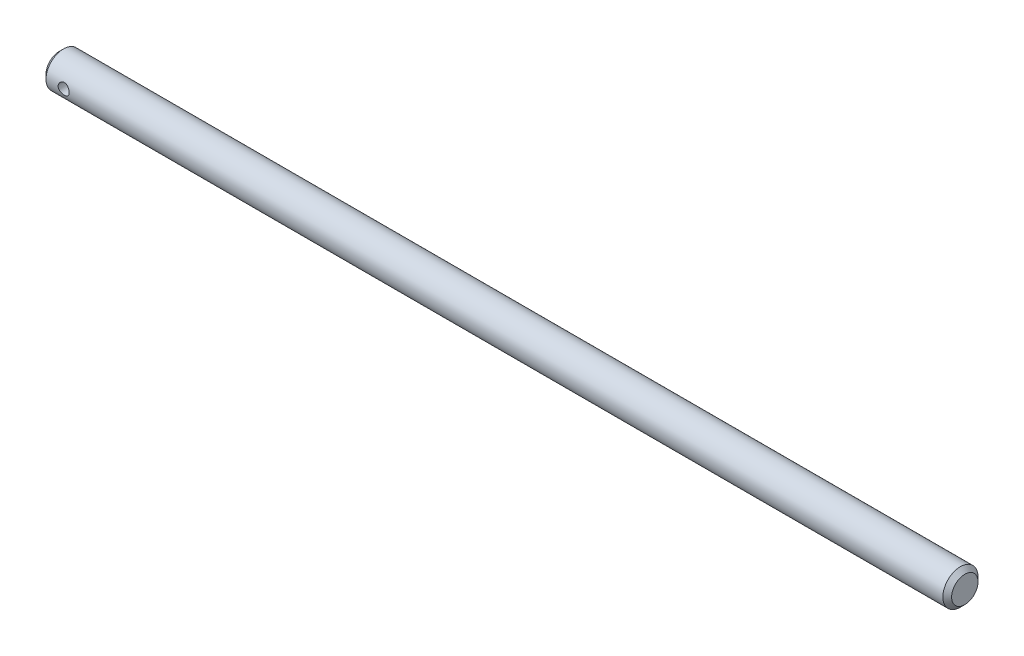
ISO-10303-21;
HEADER;
FILE_DESCRIPTION(('STEP AP214'),'2;1');
FILE_NAME('part.step','',(''),(''),'','','');
FILE_SCHEMA(('AUTOMOTIVE_DESIGN { 1 0 10303 214 1 1 1 1 }'));
ENDSEC;
DATA;
#1=APPLICATION_CONTEXT('core data for automotive mechanical design processes');
#2=APPLICATION_PROTOCOL_DEFINITION('international standard','automotive_design',2000,#1);
#3=PRODUCT_CONTEXT('',#1,'mechanical');
#4=PRODUCT('Part','Part','',(#3));
#5=PRODUCT_RELATED_PRODUCT_CATEGORY('part','',(#4));
#6=PRODUCT_DEFINITION_FORMATION('','',#4);
#7=PRODUCT_DEFINITION_CONTEXT('part definition',#1,'design');
#8=PRODUCT_DEFINITION('design','',#6,#7);
#9=PRODUCT_DEFINITION_SHAPE('','',#8);
#10=(LENGTH_UNIT() NAMED_UNIT(*) SI_UNIT(.MILLI.,.METRE.));
#11=(NAMED_UNIT(*) PLANE_ANGLE_UNIT() SI_UNIT($,.RADIAN.));
#12=(NAMED_UNIT(*) SI_UNIT($,.STERADIAN.) SOLID_ANGLE_UNIT());
#13=UNCERTAINTY_MEASURE_WITH_UNIT(LENGTH_MEASURE(1.E-05),#10,'distance_accuracy_value','');
#14=(GEOMETRIC_REPRESENTATION_CONTEXT(3) GLOBAL_UNCERTAINTY_ASSIGNED_CONTEXT((#13)) GLOBAL_UNIT_ASSIGNED_CONTEXT((#10,
#11,#12)) REPRESENTATION_CONTEXT('',''));
#15=CARTESIAN_POINT('',(0.,0.,0.));
#16=DIRECTION('',(0.,0.,1.));
#17=DIRECTION('',(1.,0.,0.));
#18=AXIS2_PLACEMENT_3D('',#15,#16,#17);
#19=CARTESIAN_POINT('',(163.5125,0.,0.));
#20=DIRECTION('',(-1.,0.,0.));
#21=DIRECTION('',(0.,0.,1.));
#22=AXIS2_PLACEMENT_3D('',#19,#20,#21);
#23=CYLINDRICAL_SURFACE('',#22,6.35);
#24=CARTESIAN_POINT('',(-153.590625,0.,-6.35));
#25=CARTESIAN_POINT('',(-153.590625708958,0.108647206464594,-6.34999945831309));
#26=CARTESIAN_POINT('',(-153.599577272774,0.217301845848293,-6.34718528288435));
#27=CARTESIAN_POINT('',(-153.635053158443,0.431433620221668,-6.3362346936598));
#28=CARTESIAN_POINT('',(-153.661581457916,0.536910030327383,-6.32809707517277));
#29=CARTESIAN_POINT('',(-153.731228876773,0.741566563045664,-6.30738857420431));
#30=CARTESIAN_POINT('',(-153.774322315886,0.840756155964977,-6.29482455629702));
#31=CARTESIAN_POINT('',(-153.875767491814,1.03050149872502,-6.26656051043234));
#32=CARTESIAN_POINT('',(-153.934121632951,1.12105588501877,-6.25085998841099));
#33=CARTESIAN_POINT('',(-154.066328887327,1.29375746923677,-6.21744714312698));
#34=CARTESIAN_POINT('',(-154.140568155034,1.37560054469872,-6.19969099034094));
#35=CARTESIAN_POINT('',(-154.301616072956,1.52590084398375,-6.16442198619055));
#36=CARTESIAN_POINT('',(-154.388427058022,1.5943555757267,-6.14690918068488));
#37=CARTESIAN_POINT('',(-154.574786995045,1.71758509166945,-6.11363942208348));
#38=CARTESIAN_POINT('',(-154.674597745574,1.77197994838332,-6.097936564291));
#39=CARTESIAN_POINT('',(-154.882520300034,1.86308588959219,-6.07072385356284));
#40=CARTESIAN_POINT('',(-154.990629908573,1.89980163237964,-6.05921289629292));
#41=CARTESIAN_POINT('',(-155.208649572955,1.9533943013893,-6.04214576087894));
#42=CARTESIAN_POINT('',(-155.318407364276,1.97083537137487,-6.03642069525594));
#43=CARTESIAN_POINT('',(-155.539429076272,1.98714606121221,-6.03107212536258));
#44=CARTESIAN_POINT('',(-155.650692588679,1.9860206183079,-6.03144699898392));
#45=CARTESIAN_POINT('',(-155.866900705677,1.96567146763226,-6.03810687657257));
#46=CARTESIAN_POINT('',(-155.971921237305,1.94716491867648,-6.04415767521693));
#47=CARTESIAN_POINT('',(-156.177285048503,1.89374166202058,-6.06110715723326));
#48=CARTESIAN_POINT('',(-156.277627829738,1.85882321028226,-6.07200635582194));
#49=CARTESIAN_POINT('',(-156.472496211787,1.7730608855653,-6.09760407372695));
#50=CARTESIAN_POINT('',(-156.566915419473,1.72199181988557,-6.11235576899058));
#51=CARTESIAN_POINT('',(-156.746079331508,1.60553432921335,-6.1439719732086));
#52=CARTESIAN_POINT('',(-156.830821514028,1.54014218453005,-6.16083703051349));
#53=CARTESIAN_POINT('',(-156.992280222674,1.39337566476413,-6.19571925383283));
#54=CARTESIAN_POINT('',(-157.068455797975,1.31140925581611,-6.21375391749042));
#55=CARTESIAN_POINT('',(-157.206111631058,1.13564099785166,-6.24826618580833));
#56=CARTESIAN_POINT('',(-157.267590800135,1.04183827279157,-6.26474367505916));
#57=CARTESIAN_POINT('',(-157.374475205654,0.844017569113914,-6.29445805638178));
#58=CARTESIAN_POINT('',(-157.419751415049,0.739925664734365,-6.3076686877903));
#59=CARTESIAN_POINT('',(-157.491990388852,0.525094164729957,-6.32917129877829));
#60=CARTESIAN_POINT('',(-157.518958714053,0.414356598775321,-6.33746477178679));
#61=CARTESIAN_POINT('',(-157.552894892594,0.193968937198424,-6.34795830664584));
#62=CARTESIAN_POINT('',(-157.560595062955,0.084442059952291,-6.35038136346505));
#63=CARTESIAN_POINT('',(-157.557841115213,-0.134350610350476,-6.34952057072936));
#64=CARTESIAN_POINT('',(-157.547389649125,-0.243616439211578,-6.34623755485052));
#65=CARTESIAN_POINT('',(-157.509216996737,-0.455960691099158,-6.33448002484496));
#66=CARTESIAN_POINT('',(-157.481931562665,-0.559125403243237,-6.32613659063216));
#67=CARTESIAN_POINT('',(-157.411397215618,-0.759383687067439,-6.30523442689622));
#68=CARTESIAN_POINT('',(-157.36814633111,-0.856476507212883,-6.29267517679021));
#69=CARTESIAN_POINT('',(-157.265730018729,-1.04446769559211,-6.26425186630585));
#70=CARTESIAN_POINT('',(-157.206202307349,-1.13515733691314,-6.24831470073047));
#71=CARTESIAN_POINT('',(-157.073356778938,-1.30550578839944,-6.21495788380444));
#72=CARTESIAN_POINT('',(-157.00003522183,-1.38516159664479,-6.1975378310852));
#73=CARTESIAN_POINT('',(-156.838239012042,-1.53445759738396,-6.16230979376987));
#74=CARTESIAN_POINT('',(-156.749279046314,-1.60357585589008,-6.14451378896475));
#75=CARTESIAN_POINT('',(-156.560636496502,-1.7259498476418,-6.11127091014274));
#76=CARTESIAN_POINT('',(-156.460954082757,-1.77920583282822,-6.09582399881705));
#77=CARTESIAN_POINT('',(-156.253902038068,-1.86801257525363,-6.06919954450254));
#78=CARTESIAN_POINT('',(-156.146564056521,-1.90363188545171,-6.05800551091538));
#79=CARTESIAN_POINT('',(-155.926992416968,-1.9561634472997,-6.04124983715342));
#80=CARTESIAN_POINT('',(-155.814760638805,-1.97308281744718,-6.03568605378198));
#81=CARTESIAN_POINT('',(-155.594043510966,-1.98722307276027,-6.03104414683278));
#82=CARTESIAN_POINT('',(-155.485618267017,-1.98530018899349,-6.03168409802724));
#83=CARTESIAN_POINT('',(-155.270716596404,-1.96387748779526,-6.03869268471746));
#84=CARTESIAN_POINT('',(-155.164240079067,-1.9443784903074,-6.0450610529767));
#85=CARTESIAN_POINT('',(-154.957789462148,-1.8889302123787,-6.06261192516131));
#86=CARTESIAN_POINT('',(-154.857742987264,-1.8532259481954,-6.07372258377032));
#87=CARTESIAN_POINT('',(-154.664980843515,-1.76657360894313,-6.0994878050412));
#88=CARTESIAN_POINT('',(-154.5722666707,-1.71562243305227,-6.11414308847041));
#89=CARTESIAN_POINT('',(-154.392874521927,-1.59759134083921,-6.14606160665685));
#90=CARTESIAN_POINT('',(-154.306574594418,-1.52995841969561,-6.16340443915194));
#91=CARTESIAN_POINT('',(-154.146271704122,-1.38145678179263,-6.1983778562867));
#92=CARTESIAN_POINT('',(-154.072272041227,-1.30058452472173,-6.21600851675563));
#93=CARTESIAN_POINT('',(-153.936251470349,-1.12472257723208,-6.25026169224552));
#94=CARTESIAN_POINT('',(-153.874700605886,-1.02935813699873,-6.26683248997443));
#95=CARTESIAN_POINT('',(-153.768585472216,-0.829118131596679,-6.29644996258793));
#96=CARTESIAN_POINT('',(-153.72401452535,-0.724246325500285,-6.30949802226367));
#97=CARTESIAN_POINT('',(-153.656361203921,-0.5171243711562,-6.32969033039384));
#98=CARTESIAN_POINT('',(-153.631781148153,-0.415401660166173,-6.3372403227975));
#99=CARTESIAN_POINT('',(-153.598914353551,-0.209121209011396,-6.34739491790518));
#100=CARTESIAN_POINT('',(-153.590624317686,-0.104564046871735,-6.35000052132933));
#101=CARTESIAN_POINT('',(-153.590625,0.,-6.35));
#102=B_SPLINE_CURVE_WITH_KNOTS('',3,(#24,#25,#26,#27,#28,#29,#30,#31,#32,#33,#34,#35,#36,#37,
#38,#39,#40,#41,#42,#43,#44,#45,#46,#47,#48,#49,#50,#51,#52,#53,#54,#55,#56,#57,#58,#59,#60,#61,
#62,#63,#64,#65,#66,#67,#68,#69,#70,#71,#72,#73,#74,#75,#76,#77,#78,#79,#80,#81,#82,#83,#84,#85,
#86,#87,#88,#89,#90,#91,#92,#93,#94,#95,#96,#97,#98,#99,#100,#101),.UNSPECIFIED.,.T.,.F.,(4,2,2,
2,2,2,2,2,2,2,2,2,2,2,2,2,2,2,2,2,2,2,2,2,2,2,2,2,2,2,2,2,2,2,2,2,2,2,4),(0.,0.325557275974112,
0.651188250816651,0.976316435733881,1.30149587547397,1.63572542734819,1.97001713297153,
2.31257111855402,2.65503479468754,2.98718525890445,3.31924739843533,3.63818356407697,
3.95715362966767,4.2807833281887,4.6044971729145,4.94294711306373,5.28142211768626,
5.62253543845017,5.96354510385112,6.29138265070334,6.61917230343371,6.93881369922568,
7.25849457992277,7.58596915522129,7.9135326506346,8.2540757370712,8.59461341436652,
8.9338168375846,9.27289109187037,9.59663123029796,9.92035626670015,10.2393418753238,
10.5583924013932,10.8899247850027,11.2215459684535,11.5639956066585,11.9063104309798,
12.2196961069949,12.5330183485151),.UNSPECIFIED.);
#103=CARTESIAN_POINT('',(-153.590625,0.,-6.35));
#104=VERTEX_POINT('',#103);
#105=EDGE_CURVE('E10',#104,#104,#102,.T.);
#106=ORIENTED_EDGE('',*,*,#105,.T.);
#107=EDGE_LOOP('',(#106));
#108=FACE_BOUND('',#107,.T.);
#109=CARTESIAN_POINT('',(-153.590625,0.,6.35));
#110=CARTESIAN_POINT('',(-153.590625708958,-0.108647206464594,6.34999945831309));
#111=CARTESIAN_POINT('',(-153.599577272774,-0.217301845848293,6.34718528288435));
#112=CARTESIAN_POINT('',(-153.635053158443,-0.431433620221668,6.3362346936598));
#113=CARTESIAN_POINT('',(-153.661581457916,-0.536910030327383,6.32809707517277));
#114=CARTESIAN_POINT('',(-153.731228876773,-0.741566563045664,6.30738857420431));
#115=CARTESIAN_POINT('',(-153.774322315886,-0.840756155964977,6.29482455629702));
#116=CARTESIAN_POINT('',(-153.875767491814,-1.03050149872502,6.26656051043234));
#117=CARTESIAN_POINT('',(-153.934121632951,-1.12105588501877,6.25085998841099));
#118=CARTESIAN_POINT('',(-154.066328887327,-1.29375746923676,6.21744714312698));
#119=CARTESIAN_POINT('',(-154.140568155034,-1.37560054469872,6.19969099034094));
#120=CARTESIAN_POINT('',(-154.301616072956,-1.52590084398375,6.16442198619055));
#121=CARTESIAN_POINT('',(-154.388427058022,-1.5943555757267,6.14690918068488));
#122=CARTESIAN_POINT('',(-154.574786995045,-1.71758509166945,6.11363942208348));
#123=CARTESIAN_POINT('',(-154.674597745574,-1.77197994838332,6.097936564291));
#124=CARTESIAN_POINT('',(-154.882520300034,-1.86308588959219,6.07072385356284));
#125=CARTESIAN_POINT('',(-154.990629908573,-1.89980163237964,6.05921289629292));
#126=CARTESIAN_POINT('',(-155.208649572955,-1.9533943013893,6.04214576087894));
#127=CARTESIAN_POINT('',(-155.318407364276,-1.97083537137487,6.03642069525594));
#128=CARTESIAN_POINT('',(-155.539429076272,-1.98714606121221,6.03107212536258));
#129=CARTESIAN_POINT('',(-155.650692588679,-1.9860206183079,6.03144699898392));
#130=CARTESIAN_POINT('',(-155.866900705677,-1.96567146763226,6.03810687657257));
#131=CARTESIAN_POINT('',(-155.971921237305,-1.94716491867648,6.04415767521693));
#132=CARTESIAN_POINT('',(-156.177285048503,-1.89374166202058,6.06110715723326));
#133=CARTESIAN_POINT('',(-156.277627829738,-1.85882321028226,6.07200635582194));
#134=CARTESIAN_POINT('',(-156.472496211787,-1.7730608855653,6.09760407372695));
#135=CARTESIAN_POINT('',(-156.566915419473,-1.72199181988557,6.11235576899058));
#136=CARTESIAN_POINT('',(-156.746079331508,-1.60553432921335,6.1439719732086));
#137=CARTESIAN_POINT('',(-156.830821514028,-1.54014218453005,6.16083703051349));
#138=CARTESIAN_POINT('',(-156.992280222674,-1.39337566476413,6.19571925383283));
#139=CARTESIAN_POINT('',(-157.068455797975,-1.31140925581611,6.21375391749042));
#140=CARTESIAN_POINT('',(-157.206111631058,-1.13564099785166,6.24826618580833));
#141=CARTESIAN_POINT('',(-157.267590800135,-1.04183827279157,6.26474367505916));
#142=CARTESIAN_POINT('',(-157.374475205654,-0.844017569113914,6.29445805638178));
#143=CARTESIAN_POINT('',(-157.419751415049,-0.739925664734365,6.3076686877903));
#144=CARTESIAN_POINT('',(-157.491990388852,-0.525094164729956,6.32917129877829));
#145=CARTESIAN_POINT('',(-157.518958714053,-0.41435659877532,6.33746477178679));
#146=CARTESIAN_POINT('',(-157.552894892594,-0.193968937198424,6.34795830664584));
#147=CARTESIAN_POINT('',(-157.560595062955,-0.0844420599522901,6.35038136346505));
#148=CARTESIAN_POINT('',(-157.557841115213,0.134350610350477,6.34952057072936));
#149=CARTESIAN_POINT('',(-157.547389649125,0.243616439211579,6.34623755485052));
#150=CARTESIAN_POINT('',(-157.509216996737,0.455960691099159,6.33448002484496));
#151=CARTESIAN_POINT('',(-157.481931562665,0.559125403243238,6.32613659063216));
#152=CARTESIAN_POINT('',(-157.411397215618,0.759383687067439,6.30523442689622));
#153=CARTESIAN_POINT('',(-157.36814633111,0.856476507212884,6.29267517679021));
#154=CARTESIAN_POINT('',(-157.265730018729,1.04446769559211,6.26425186630585));
#155=CARTESIAN_POINT('',(-157.206202307349,1.13515733691314,6.24831470073047));
#156=CARTESIAN_POINT('',(-157.073356778938,1.30550578839944,6.21495788380444));
#157=CARTESIAN_POINT('',(-157.00003522183,1.38516159664479,6.1975378310852));
#158=CARTESIAN_POINT('',(-156.838239012042,1.53445759738396,6.16230979376987));
#159=CARTESIAN_POINT('',(-156.749279046314,1.60357585589008,6.14451378896475));
#160=CARTESIAN_POINT('',(-156.560636496502,1.7259498476418,6.11127091014274));
#161=CARTESIAN_POINT('',(-156.460954082757,1.77920583282822,6.09582399881705));
#162=CARTESIAN_POINT('',(-156.253902038068,1.86801257525363,6.06919954450254));
#163=CARTESIAN_POINT('',(-156.146564056521,1.90363188545171,6.05800551091538));
#164=CARTESIAN_POINT('',(-155.926992416968,1.9561634472997,6.04124983715342));
#165=CARTESIAN_POINT('',(-155.814760638805,1.97308281744718,6.03568605378198));
#166=CARTESIAN_POINT('',(-155.594043510966,1.98722307276027,6.03104414683278));
#167=CARTESIAN_POINT('',(-155.485618267017,1.98530018899349,6.03168409802724));
#168=CARTESIAN_POINT('',(-155.270716596404,1.96387748779526,6.03869268471746));
#169=CARTESIAN_POINT('',(-155.164240079067,1.9443784903074,6.0450610529767));
#170=CARTESIAN_POINT('',(-154.957789462148,1.8889302123787,6.06261192516131));
#171=CARTESIAN_POINT('',(-154.857742987264,1.8532259481954,6.07372258377032));
#172=CARTESIAN_POINT('',(-154.664980843515,1.76657360894313,6.0994878050412));
#173=CARTESIAN_POINT('',(-154.5722666707,1.71562243305227,6.11414308847041));
#174=CARTESIAN_POINT('',(-154.392874521927,1.59759134083921,6.14606160665685));
#175=CARTESIAN_POINT('',(-154.306574594418,1.52995841969561,6.16340443915193));
#176=CARTESIAN_POINT('',(-154.146271704122,1.38145678179263,6.1983778562867));
#177=CARTESIAN_POINT('',(-154.072272041227,1.30058452472173,6.21600851675563));
#178=CARTESIAN_POINT('',(-153.936251470349,1.12472257723208,6.25026169224552));
#179=CARTESIAN_POINT('',(-153.874700605886,1.02935813699873,6.26683248997443));
#180=CARTESIAN_POINT('',(-153.768585472216,0.829118131596678,6.29644996258793));
#181=CARTESIAN_POINT('',(-153.72401452535,0.724246325500284,6.30949802226367));
#182=CARTESIAN_POINT('',(-153.656361203921,0.5171243711562,6.32969033039384));
#183=CARTESIAN_POINT('',(-153.631781148153,0.415401660166174,6.33724032279749));
#184=CARTESIAN_POINT('',(-153.598914353551,0.209121209011397,6.34739491790517));
#185=CARTESIAN_POINT('',(-153.590624317686,0.104564046871736,6.35000052132933));
#186=CARTESIAN_POINT('',(-153.590625,0.,6.35));
#187=B_SPLINE_CURVE_WITH_KNOTS('',3,(#109,#110,#111,#112,#113,#114,#115,#116,#117,#118,#119,
#120,#121,#122,#123,#124,#125,#126,#127,#128,#129,#130,#131,#132,#133,#134,#135,#136,#137,#138,
#139,#140,#141,#142,#143,#144,#145,#146,#147,#148,#149,#150,#151,#152,#153,#154,#155,#156,#157,
#158,#159,#160,#161,#162,#163,#164,#165,#166,#167,#168,#169,#170,#171,#172,#173,#174,#175,#176,
#177,#178,#179,#180,#181,#182,#183,#184,#185,#186),.UNSPECIFIED.,.T.,.F.,(4,2,2,2,2,2,2,2,2,2,2,
2,2,2,2,2,2,2,2,2,2,2,2,2,2,2,2,2,2,2,2,2,2,2,2,2,2,2,4),(0.,0.325557275974112,
0.651188250816651,0.976316435733881,1.30149587547397,1.63572542734816,1.97001713297153,
2.31257111855402,2.65503479468754,2.98718525890445,3.31924739843533,3.63818356407697,
3.95715362966768,4.2807833281887,4.60449717291451,4.94294711306373,5.28142211768626,
5.62253543845017,5.96354510385112,6.29138265070335,6.61917230343371,6.93881369922568,
7.25849457992278,7.5859691552213,7.9135326506346,8.2540757370712,8.59461341436652,
8.9338168375846,9.27289109187037,9.59663123029796,9.92035626670015,10.2393418753239,
10.5583924013932,10.8899247850027,11.2215459684535,11.5639956066585,11.9063104309798,
12.2196961069949,12.5330183485151),.UNSPECIFIED.);
#188=CARTESIAN_POINT('',(-153.590625,0.,6.35));
#189=VERTEX_POINT('',#188);
#190=EDGE_CURVE('E57',#189,#189,#187,.T.);
#191=ORIENTED_EDGE('',*,*,#190,.T.);
#192=EDGE_LOOP('',(#191));
#193=FACE_BOUND('',#192,.T.);
#194=CARTESIAN_POINT('',(-161.925,0.,0.));
#195=DIRECTION('',(1.,0.,0.));
#196=DIRECTION('',(0.,0.,-1.));
#197=AXIS2_PLACEMENT_3D('',#194,#195,#196);
#198=CIRCLE('',#197,6.35);
#199=CARTESIAN_POINT('',(-161.925,0.,-6.35));
#200=VERTEX_POINT('',#199);
#201=EDGE_CURVE('E101',#200,#200,#198,.T.);
#202=ORIENTED_EDGE('',*,*,#201,.T.);
#203=EDGE_LOOP('',(#202));
#204=FACE_BOUND('',#203,.T.);
#205=CARTESIAN_POINT('',(161.925,0.,0.));
#206=DIRECTION('',(1.,0.,0.));
#207=DIRECTION('',(0.,0.,-1.));
#208=AXIS2_PLACEMENT_3D('',#205,#206,#207);
#209=CIRCLE('',#208,6.35);
#210=CARTESIAN_POINT('',(161.925,0.,-6.35));
#211=VERTEX_POINT('',#210);
#212=EDGE_CURVE('E104',#211,#211,#209,.F.);
#213=ORIENTED_EDGE('',*,*,#212,.T.);
#214=EDGE_LOOP('',(#213));
#215=FACE_BOUND('',#214,.T.);
#216=ADVANCED_FACE('F43',(#108,#193,#204,#215),#23,.T.);
#217=CARTESIAN_POINT('',(163.5125,0.,0.));
#218=DIRECTION('',(1.,0.,0.));
#219=DIRECTION('',(0.,0.,-1.));
#220=AXIS2_PLACEMENT_3D('',#217,#218,#219);
#221=PLANE('',#220);
#222=CARTESIAN_POINT('',(163.5125,0.,0.));
#223=DIRECTION('',(1.,0.,0.));
#224=DIRECTION('',(0.,0.,-1.));
#225=AXIS2_PLACEMENT_3D('',#222,#223,#224);
#226=CIRCLE('',#225,4.76250000000014);
#227=CARTESIAN_POINT('',(163.5125,0.,-4.76250000000014));
#228=VERTEX_POINT('',#227);
#229=EDGE_CURVE('E62',#228,#228,#226,.T.);
#230=ORIENTED_EDGE('',*,*,#229,.T.);
#231=EDGE_LOOP('',(#230));
#232=FACE_BOUND('',#231,.T.);
#233=ADVANCED_FACE('F80',(#232),#221,.T.);
#234=CARTESIAN_POINT('',(-163.5125,0.,0.));
#235=DIRECTION('',(1.,0.,0.));
#236=DIRECTION('',(0.,0.,-1.));
#237=AXIS2_PLACEMENT_3D('',#234,#235,#236);
#238=PLANE('',#237);
#239=CARTESIAN_POINT('',(-163.5125,0.,0.));
#240=DIRECTION('',(1.,0.,0.));
#241=DIRECTION('',(0.,0.,-1.));
#242=AXIS2_PLACEMENT_3D('',#239,#240,#241);
#243=CIRCLE('',#242,4.76249999999978);
#244=CARTESIAN_POINT('',(-163.5125,0.,-4.76249999999978));
#245=VERTEX_POINT('',#244);
#246=EDGE_CURVE('E67',#245,#245,#243,.F.);
#247=ORIENTED_EDGE('',*,*,#246,.T.);
#248=EDGE_LOOP('',(#247));
#249=FACE_BOUND('',#248,.T.);
#250=ADVANCED_FACE('F83',(#249),#238,.F.);
#251=CARTESIAN_POINT('',(-161.925,0.,0.));
#252=DIRECTION('',(1.,0.,0.));
#253=DIRECTION('',(0.,0.,-1.));
#254=AXIS2_PLACEMENT_3D('',#251,#252,#253);
#255=CONICAL_SURFACE('',#254,6.35,0.785398163397459);
#256=ORIENTED_EDGE('',*,*,#246,.F.);
#257=EDGE_LOOP('',(#256));
#258=FACE_BOUND('',#257,.T.);
#259=ORIENTED_EDGE('',*,*,#201,.F.);
#260=EDGE_LOOP('',(#259));
#261=FACE_BOUND('',#260,.T.);
#262=ADVANCED_FACE('F86',(#258,#261),#255,.T.);
#263=CARTESIAN_POINT('',(163.5125,0.,0.));
#264=DIRECTION('',(-1.,0.,0.));
#265=DIRECTION('',(0.,0.,1.));
#266=AXIS2_PLACEMENT_3D('',#263,#264,#265);
#267=CONICAL_SURFACE('',#266,4.76250000000014,0.78539816339745);
#268=ORIENTED_EDGE('',*,*,#212,.F.);
#269=EDGE_LOOP('',(#268));
#270=FACE_BOUND('',#269,.T.);
#271=ORIENTED_EDGE('',*,*,#229,.F.);
#272=EDGE_LOOP('',(#271));
#273=FACE_BOUND('',#272,.T.);
#274=ADVANCED_FACE('F46',(#270,#273),#267,.T.);
#275=CARTESIAN_POINT('',(-155.575,0.,-6.35));
#276=DIRECTION('',(0.,0.,1.));
#277=DIRECTION('',(1.,0.,0.));
#278=AXIS2_PLACEMENT_3D('',#275,#276,#277);
#279=CYLINDRICAL_SURFACE('',#278,1.98437500000002);
#280=ORIENTED_EDGE('',*,*,#190,.F.);
#281=EDGE_LOOP('',(#280));
#282=FACE_BOUND('',#281,.T.);
#283=ORIENTED_EDGE('',*,*,#105,.F.);
#284=EDGE_LOOP('',(#283));
#285=FACE_BOUND('',#284,.T.);
#286=ADVANCED_FACE('F75',(#282,#285),#279,.F.);
#287=CLOSED_SHELL('',(#216,#233,#250,#262,#274,#286));
#288=MANIFOLD_SOLID_BREP('B2',#287);
#289=ADVANCED_BREP_SHAPE_REPRESENTATION('',(#18,#288),#14);
#290=SHAPE_DEFINITION_REPRESENTATION(#9,#289);
ENDSEC;
END-ISO-10303-21;
